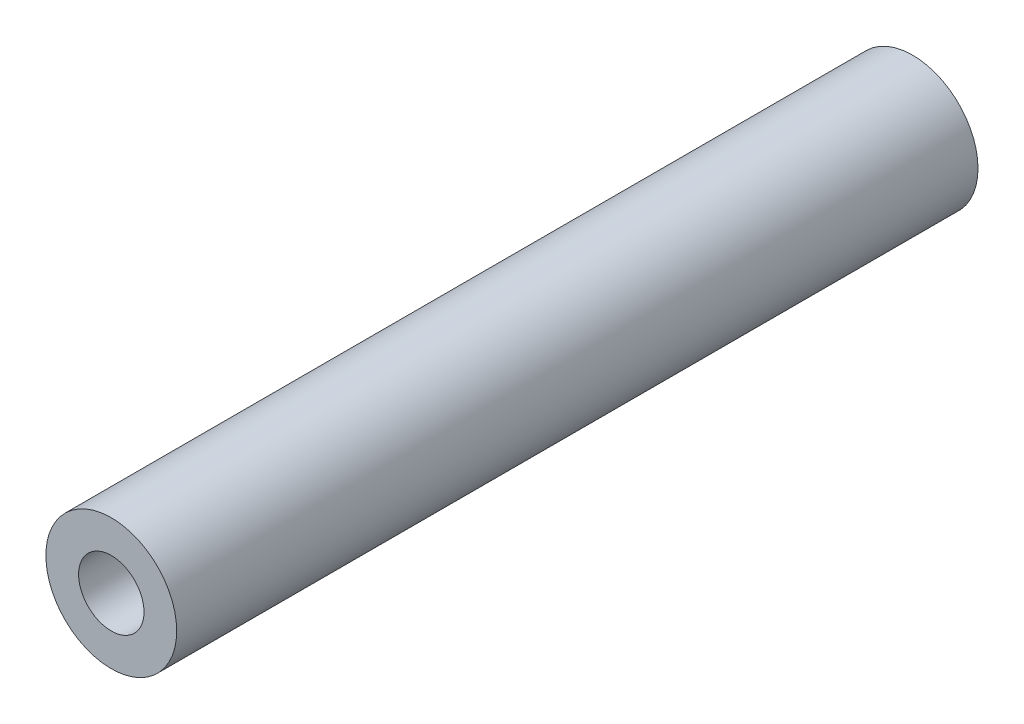
ISO-10303-21;
HEADER;
FILE_DESCRIPTION(('STEP AP214'),'2;1');
FILE_NAME('part.step','',(''),(''),'','','');
FILE_SCHEMA(('AUTOMOTIVE_DESIGN { 1 0 10303 214 1 1 1 1 }'));
ENDSEC;
DATA;
#1=APPLICATION_CONTEXT('core data for automotive mechanical design processes');
#2=APPLICATION_PROTOCOL_DEFINITION('international standard','automotive_design',2000,#1);
#3=PRODUCT_CONTEXT('',#1,'mechanical');
#4=PRODUCT('Part','Part','',(#3));
#5=PRODUCT_RELATED_PRODUCT_CATEGORY('part','',(#4));
#6=PRODUCT_DEFINITION_FORMATION('','',#4);
#7=PRODUCT_DEFINITION_CONTEXT('part definition',#1,'design');
#8=PRODUCT_DEFINITION('design','',#6,#7);
#9=PRODUCT_DEFINITION_SHAPE('','',#8);
#10=(LENGTH_UNIT() NAMED_UNIT(*) SI_UNIT(.MILLI.,.METRE.));
#11=(NAMED_UNIT(*) PLANE_ANGLE_UNIT() SI_UNIT($,.RADIAN.));
#12=(NAMED_UNIT(*) SI_UNIT($,.STERADIAN.) SOLID_ANGLE_UNIT());
#13=UNCERTAINTY_MEASURE_WITH_UNIT(LENGTH_MEASURE(1.E-05),#10,'distance_accuracy_value','');
#14=(GEOMETRIC_REPRESENTATION_CONTEXT(3) GLOBAL_UNCERTAINTY_ASSIGNED_CONTEXT((#13)) GLOBAL_UNIT_ASSIGNED_CONTEXT((#10,
#11,#12)) REPRESENTATION_CONTEXT('',''));
#15=CARTESIAN_POINT('',(0.,0.,0.));
#16=DIRECTION('',(0.,0.,1.));
#17=DIRECTION('',(1.,0.,0.));
#18=AXIS2_PLACEMENT_3D('',#15,#16,#17);
#19=CARTESIAN_POINT('',(0.,0.,49.));
#20=DIRECTION('',(0.,0.,-1.));
#21=DIRECTION('',(-1.,0.,0.));
#22=AXIS2_PLACEMENT_3D('',#19,#20,#21);
#23=CYLINDRICAL_SURFACE('',#22,4.);
#24=CARTESIAN_POINT('',(0.,0.,49.));
#25=DIRECTION('',(0.,0.,1.));
#26=DIRECTION('',(1.,0.,0.));
#27=AXIS2_PLACEMENT_3D('',#24,#25,#26);
#28=CIRCLE('',#27,4.);
#29=CARTESIAN_POINT('',(4.,0.,49.));
#30=VERTEX_POINT('',#29);
#31=EDGE_CURVE('E10',#30,#30,#28,.T.);
#32=ORIENTED_EDGE('',*,*,#31,.F.);
#33=EDGE_LOOP('',(#32));
#34=FACE_BOUND('',#33,.T.);
#35=CARTESIAN_POINT('',(0.,0.,0.));
#36=DIRECTION('',(0.,0.,1.));
#37=DIRECTION('',(1.,0.,0.));
#38=AXIS2_PLACEMENT_3D('',#35,#36,#37);
#39=CIRCLE('',#38,4.);
#40=CARTESIAN_POINT('',(4.,0.,0.));
#41=VERTEX_POINT('',#40);
#42=EDGE_CURVE('E32',#41,#41,#39,.T.);
#43=ORIENTED_EDGE('',*,*,#42,.T.);
#44=EDGE_LOOP('',(#43));
#45=FACE_BOUND('',#44,.T.);
#46=ADVANCED_FACE('F29',(#34,#45),#23,.T.);
#47=CARTESIAN_POINT('',(0.,0.,49.));
#48=DIRECTION('',(0.,0.,1.));
#49=DIRECTION('',(1.,0.,0.));
#50=AXIS2_PLACEMENT_3D('',#47,#48,#49);
#51=PLANE('',#50);
#52=CARTESIAN_POINT('',(0.,0.,49.));
#53=DIRECTION('',(0.,0.,1.));
#54=DIRECTION('',(1.,0.,0.));
#55=AXIS2_PLACEMENT_3D('',#52,#53,#54);
#56=CIRCLE('',#55,2.);
#57=CARTESIAN_POINT('',(2.,0.,49.));
#58=VERTEX_POINT('',#57);
#59=EDGE_CURVE('E41',#58,#58,#56,.T.);
#60=ORIENTED_EDGE('',*,*,#59,.F.);
#61=EDGE_LOOP('',(#60));
#62=FACE_BOUND('',#61,.T.);
#63=ORIENTED_EDGE('',*,*,#31,.T.);
#64=EDGE_LOOP('',(#63));
#65=FACE_BOUND('',#64,.T.);
#66=ADVANCED_FACE('F66',(#62,#65),#51,.T.);
#67=CARTESIAN_POINT('',(0.,0.,0.));
#68=DIRECTION('',(0.,0.,1.));
#69=DIRECTION('',(1.,0.,0.));
#70=AXIS2_PLACEMENT_3D('',#67,#68,#69);
#71=PLANE('',#70);
#72=CARTESIAN_POINT('',(0.,0.,0.));
#73=DIRECTION('',(0.,0.,-1.));
#74=DIRECTION('',(-1.,0.,0.));
#75=AXIS2_PLACEMENT_3D('',#72,#73,#74);
#76=CIRCLE('',#75,2.);
#77=CARTESIAN_POINT('',(-2.,0.,0.));
#78=VERTEX_POINT('',#77);
#79=EDGE_CURVE('E47',#78,#78,#76,.T.);
#80=ORIENTED_EDGE('',*,*,#79,.F.);
#81=EDGE_LOOP('',(#80));
#82=FACE_BOUND('',#81,.T.);
#83=ORIENTED_EDGE('',*,*,#42,.F.);
#84=EDGE_LOOP('',(#83));
#85=FACE_BOUND('',#84,.T.);
#86=ADVANCED_FACE('F62',(#82,#85),#71,.F.);
#87=CARTESIAN_POINT('',(0.,0.,39.));
#88=DIRECTION('',(0.,0.,1.));
#89=DIRECTION('',(1.,0.,0.));
#90=AXIS2_PLACEMENT_3D('',#87,#88,#89);
#91=CYLINDRICAL_SURFACE('',#90,2.);
#92=CARTESIAN_POINT('',(0.,0.,39.));
#93=DIRECTION('',(0.,0.,1.));
#94=DIRECTION('',(1.,0.,0.));
#95=AXIS2_PLACEMENT_3D('',#92,#93,#94);
#96=CIRCLE('',#95,2.);
#97=CARTESIAN_POINT('',(2.,0.,39.));
#98=VERTEX_POINT('',#97);
#99=EDGE_CURVE('E39',#98,#98,#96,.T.);
#100=ORIENTED_EDGE('',*,*,#99,.F.);
#101=EDGE_LOOP('',(#100));
#102=FACE_BOUND('',#101,.T.);
#103=ORIENTED_EDGE('',*,*,#59,.T.);
#104=EDGE_LOOP('',(#103));
#105=FACE_BOUND('',#104,.T.);
#106=ADVANCED_FACE('F65',(#102,#105),#91,.F.);
#107=CARTESIAN_POINT('',(0.,0.,39.));
#108=DIRECTION('',(0.,0.,1.));
#109=DIRECTION('',(1.,0.,0.));
#110=AXIS2_PLACEMENT_3D('',#107,#108,#109);
#111=PLANE('',#110);
#112=ORIENTED_EDGE('',*,*,#99,.T.);
#113=EDGE_LOOP('',(#112));
#114=FACE_BOUND('',#113,.T.);
#115=ADVANCED_FACE('F58',(#114),#111,.T.);
#116=CARTESIAN_POINT('',(0.,0.,10.));
#117=DIRECTION('',(0.,0.,-1.));
#118=DIRECTION('',(-1.,0.,0.));
#119=AXIS2_PLACEMENT_3D('',#116,#117,#118);
#120=CYLINDRICAL_SURFACE('',#119,2.);
#121=CARTESIAN_POINT('',(0.,0.,10.));
#122=DIRECTION('',(0.,0.,-1.));
#123=DIRECTION('',(-1.,0.,0.));
#124=AXIS2_PLACEMENT_3D('',#121,#122,#123);
#125=CIRCLE('',#124,2.);
#126=CARTESIAN_POINT('',(-2.,0.,10.));
#127=VERTEX_POINT('',#126);
#128=EDGE_CURVE('E44',#127,#127,#125,.T.);
#129=ORIENTED_EDGE('',*,*,#128,.F.);
#130=EDGE_LOOP('',(#129));
#131=FACE_BOUND('',#130,.T.);
#132=ORIENTED_EDGE('',*,*,#79,.T.);
#133=EDGE_LOOP('',(#132));
#134=FACE_BOUND('',#133,.T.);
#135=ADVANCED_FACE('F55',(#131,#134),#120,.F.);
#136=CARTESIAN_POINT('',(0.,0.,10.));
#137=DIRECTION('',(0.,0.,-1.));
#138=DIRECTION('',(-1.,0.,0.));
#139=AXIS2_PLACEMENT_3D('',#136,#137,#138);
#140=PLANE('',#139);
#141=ORIENTED_EDGE('',*,*,#128,.T.);
#142=EDGE_LOOP('',(#141));
#143=FACE_BOUND('',#142,.T.);
#144=ADVANCED_FACE('F53',(#143),#140,.T.);
#145=CLOSED_SHELL('',(#46,#66,#86,#106,#115,#135,#144));
#146=MANIFOLD_SOLID_BREP('B2',#145);
#147=ADVANCED_BREP_SHAPE_REPRESENTATION('',(#18,#146),#14);
#148=SHAPE_DEFINITION_REPRESENTATION(#9,#147);
ENDSEC;
END-ISO-10303-21;
